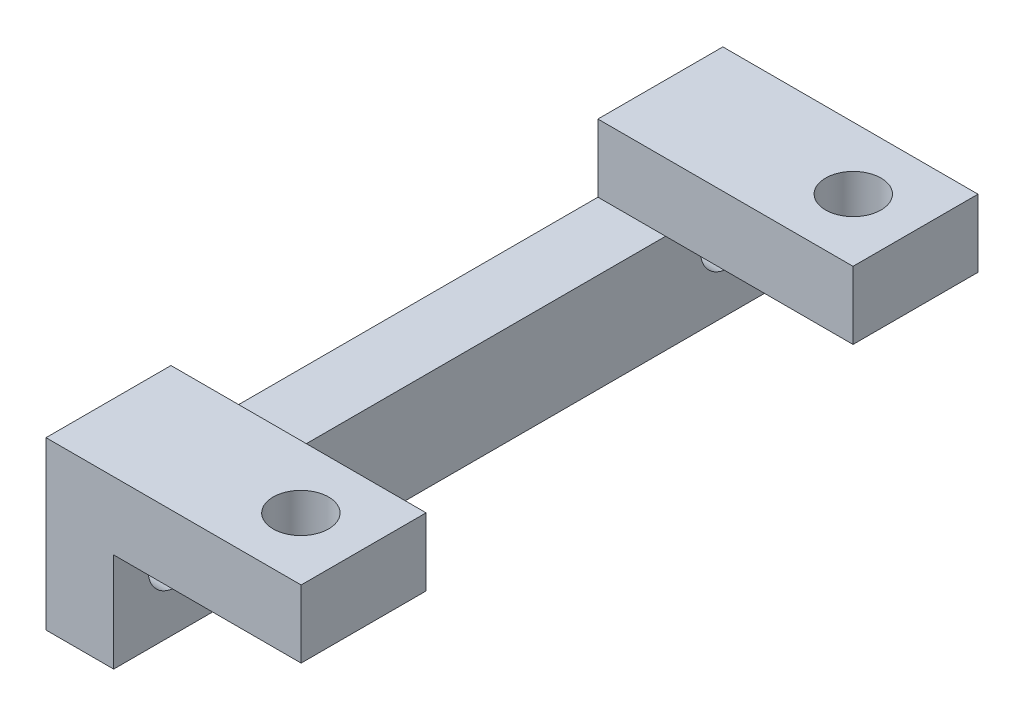
ISO-10303-21;
HEADER;
FILE_DESCRIPTION(('STEP AP214'),'2;1');
FILE_NAME('part.step','',(''),(''),'','','');
FILE_SCHEMA(('AUTOMOTIVE_DESIGN { 1 0 10303 214 1 1 1 1 }'));
ENDSEC;
DATA;
#1=APPLICATION_CONTEXT('core data for automotive mechanical design processes');
#2=APPLICATION_PROTOCOL_DEFINITION('international standard','automotive_design',2000,#1);
#3=PRODUCT_CONTEXT('',#1,'mechanical');
#4=PRODUCT('Part','Part','',(#3));
#5=PRODUCT_RELATED_PRODUCT_CATEGORY('part','',(#4));
#6=PRODUCT_DEFINITION_FORMATION('','',#4);
#7=PRODUCT_DEFINITION_CONTEXT('part definition',#1,'design');
#8=PRODUCT_DEFINITION('design','',#6,#7);
#9=PRODUCT_DEFINITION_SHAPE('','',#8);
#10=(LENGTH_UNIT() NAMED_UNIT(*) SI_UNIT(.MILLI.,.METRE.));
#11=(NAMED_UNIT(*) PLANE_ANGLE_UNIT() SI_UNIT($,.RADIAN.));
#12=(NAMED_UNIT(*) SI_UNIT($,.STERADIAN.) SOLID_ANGLE_UNIT());
#13=UNCERTAINTY_MEASURE_WITH_UNIT(LENGTH_MEASURE(1.E-05),#10,'distance_accuracy_value','');
#14=(GEOMETRIC_REPRESENTATION_CONTEXT(3) GLOBAL_UNCERTAINTY_ASSIGNED_CONTEXT((#13)) GLOBAL_UNIT_ASSIGNED_CONTEXT((#10,
#11,#12)) REPRESENTATION_CONTEXT('',''));
#15=CARTESIAN_POINT('',(0.,0.,0.));
#16=DIRECTION('',(0.,0.,1.));
#17=DIRECTION('',(1.,0.,0.));
#18=AXIS2_PLACEMENT_3D('',#15,#16,#17);
#19=CARTESIAN_POINT('',(3.302,0.,0.));
#20=DIRECTION('',(0.,0.,-1.));
#21=DIRECTION('',(-1.,0.,0.));
#22=AXIS2_PLACEMENT_3D('',#19,#20,#21);
#23=PLANE('',#22);
#24=DIRECTION('',(0.,-1.,0.));
#25=VECTOR('',#24,1.);
#26=CARTESIAN_POINT('',(0.,0.,0.));
#27=LINE('',#26,#25);
#28=CARTESIAN_POINT('',(0.,8.128,0.));
#29=VERTEX_POINT('',#28);
#30=CARTESIAN_POINT('',(0.,0.,0.));
#31=VERTEX_POINT('',#30);
#32=EDGE_CURVE('E184',#29,#31,#27,.T.);
#33=ORIENTED_EDGE('',*,*,#32,.T.);
#34=DIRECTION('',(-1.,0.,0.));
#35=VECTOR('',#34,1.);
#36=CARTESIAN_POINT('',(3.302,0.,0.));
#37=LINE('',#36,#35);
#38=CARTESIAN_POINT('',(3.302,0.,0.));
#39=VERTEX_POINT('',#38);
#40=EDGE_CURVE('E38',#39,#31,#37,.T.);
#41=ORIENTED_EDGE('',*,*,#40,.F.);
#42=DIRECTION('',(0.,-1.,0.));
#43=VECTOR('',#42,1.);
#44=CARTESIAN_POINT('',(3.302,0.,0.));
#45=LINE('',#44,#43);
#46=CARTESIAN_POINT('',(3.302,4.826,0.));
#47=VERTEX_POINT('',#46);
#48=EDGE_CURVE('E190',#47,#39,#45,.T.);
#49=ORIENTED_EDGE('',*,*,#48,.F.);
#50=DIRECTION('',(-1.,0.,0.));
#51=VECTOR('',#50,1.);
#52=CARTESIAN_POINT('',(12.446,4.826,0.));
#53=LINE('',#52,#51);
#54=CARTESIAN_POINT('',(12.446,4.826,0.));
#55=VERTEX_POINT('',#54);
#56=EDGE_CURVE('E143',#55,#47,#53,.T.);
#57=ORIENTED_EDGE('',*,*,#56,.F.);
#58=DIRECTION('',(0.,1.,0.));
#59=VECTOR('',#58,1.);
#60=CARTESIAN_POINT('',(12.446,4.826,0.));
#61=LINE('',#60,#59);
#62=CARTESIAN_POINT('',(12.446,8.128,0.));
#63=VERTEX_POINT('',#62);
#64=EDGE_CURVE('E136',#55,#63,#61,.T.);
#65=ORIENTED_EDGE('',*,*,#64,.T.);
#66=DIRECTION('',(-1.,0.,0.));
#67=VECTOR('',#66,1.);
#68=CARTESIAN_POINT('',(12.446,8.128,0.));
#69=LINE('',#68,#67);
#70=EDGE_CURVE('E119',#63,#29,#69,.T.);
#71=ORIENTED_EDGE('',*,*,#70,.T.);
#72=EDGE_LOOP('',(#33,#41,#49,#57,#65,#71));
#73=FACE_BOUND('',#72,.T.);
#74=ADVANCED_FACE('F35',(#73),#23,.F.);
#75=CARTESIAN_POINT('',(3.302,0.,0.));
#76=DIRECTION('',(0.,1.,0.));
#77=DIRECTION('',(0.,0.,1.));
#78=AXIS2_PLACEMENT_3D('',#75,#76,#77);
#79=PLANE('',#78);
#80=DIRECTION('',(0.,0.,-1.));
#81=VECTOR('',#80,1.);
#82=CARTESIAN_POINT('',(0.,0.,0.));
#83=LINE('',#82,#81);
#84=CARTESIAN_POINT('',(0.,0.,-33.02));
#85=VERTEX_POINT('',#84);
#86=EDGE_CURVE('E204',#31,#85,#83,.T.);
#87=ORIENTED_EDGE('',*,*,#86,.T.);
#88=DIRECTION('',(-1.,0.,0.));
#89=VECTOR('',#88,1.);
#90=CARTESIAN_POINT('',(3.302,0.,-33.02));
#91=LINE('',#90,#89);
#92=CARTESIAN_POINT('',(3.302,0.,-33.02));
#93=VERTEX_POINT('',#92);
#94=EDGE_CURVE('E202',#93,#85,#91,.T.);
#95=ORIENTED_EDGE('',*,*,#94,.F.);
#96=DIRECTION('',(0.,0.,-1.));
#97=VECTOR('',#96,1.);
#98=CARTESIAN_POINT('',(3.302,0.,0.));
#99=LINE('',#98,#97);
#100=EDGE_CURVE('E193',#39,#93,#99,.T.);
#101=ORIENTED_EDGE('',*,*,#100,.F.);
#102=ORIENTED_EDGE('',*,*,#40,.T.);
#103=EDGE_LOOP('',(#87,#95,#101,#102));
#104=FACE_BOUND('',#103,.T.);
#105=ADVANCED_FACE('F216',(#104),#79,.F.);
#106=CARTESIAN_POINT('',(3.302,0.,-33.02));
#107=DIRECTION('',(0.,0.,1.));
#108=DIRECTION('',(1.,0.,0.));
#109=AXIS2_PLACEMENT_3D('',#106,#107,#108);
#110=PLANE('',#109);
#111=DIRECTION('',(0.,1.,0.));
#112=VECTOR('',#111,1.);
#113=CARTESIAN_POINT('',(0.,0.,-33.02));
#114=LINE('',#113,#112);
#115=CARTESIAN_POINT('',(0.,8.128,-33.02));
#116=VERTEX_POINT('',#115);
#117=EDGE_CURVE('E206',#85,#116,#114,.T.);
#118=ORIENTED_EDGE('',*,*,#117,.T.);
#119=DIRECTION('',(-1.,0.,0.));
#120=VECTOR('',#119,1.);
#121=CARTESIAN_POINT('',(12.446,8.128,-33.02));
#122=LINE('',#121,#120);
#123=CARTESIAN_POINT('',(12.446,8.128,-33.02));
#124=VERTEX_POINT('',#123);
#125=EDGE_CURVE('E181',#124,#116,#122,.T.);
#126=ORIENTED_EDGE('',*,*,#125,.F.);
#127=DIRECTION('',(0.,-1.,0.));
#128=VECTOR('',#127,1.);
#129=CARTESIAN_POINT('',(12.446,4.826,-33.02));
#130=LINE('',#129,#128);
#131=CARTESIAN_POINT('',(12.446,4.826,-33.02));
#132=VERTEX_POINT('',#131);
#133=EDGE_CURVE('E163',#124,#132,#130,.T.);
#134=ORIENTED_EDGE('',*,*,#133,.T.);
#135=DIRECTION('',(-1.,0.,0.));
#136=VECTOR('',#135,1.);
#137=CARTESIAN_POINT('',(12.446,4.826,-33.02));
#138=LINE('',#137,#136);
#139=CARTESIAN_POINT('',(3.302,4.826,-33.02));
#140=VERTEX_POINT('',#139);
#141=EDGE_CURVE('E176',#132,#140,#138,.T.);
#142=ORIENTED_EDGE('',*,*,#141,.T.);
#143=DIRECTION('',(0.,1.,0.));
#144=VECTOR('',#143,1.);
#145=CARTESIAN_POINT('',(3.302,0.,-33.02));
#146=LINE('',#145,#144);
#147=EDGE_CURVE('E195',#93,#140,#146,.T.);
#148=ORIENTED_EDGE('',*,*,#147,.F.);
#149=ORIENTED_EDGE('',*,*,#94,.T.);
#150=EDGE_LOOP('',(#118,#126,#134,#142,#148,#149));
#151=FACE_BOUND('',#150,.T.);
#152=ADVANCED_FACE('F220',(#151),#110,.F.);
#153=CARTESIAN_POINT('',(3.302,4.826,0.));
#154=DIRECTION('',(0.,-1.,0.));
#155=DIRECTION('',(0.,0.,-1.));
#156=AXIS2_PLACEMENT_3D('',#153,#154,#155);
#157=PLANE('',#156);
#158=DIRECTION('',(0.,0.,1.));
#159=VECTOR('',#158,1.);
#160=CARTESIAN_POINT('',(0.,4.826,0.));
#161=LINE('',#160,#159);
#162=CARTESIAN_POINT('',(0.,4.826,-26.924));
#163=VERTEX_POINT('',#162);
#164=CARTESIAN_POINT('',(0.,4.826,-6.096));
#165=VERTEX_POINT('',#164);
#166=EDGE_CURVE('E55',#163,#165,#161,.T.);
#167=ORIENTED_EDGE('',*,*,#166,.T.);
#168=DIRECTION('',(-1.,0.,0.));
#169=VECTOR('',#168,1.);
#170=CARTESIAN_POINT('',(12.446,4.826,-6.096));
#171=LINE('',#170,#169);
#172=CARTESIAN_POINT('',(3.302,4.826,-6.096));
#173=VERTEX_POINT('',#172);
#174=EDGE_CURVE('E51',#173,#165,#171,.T.);
#175=ORIENTED_EDGE('',*,*,#174,.F.);
#176=DIRECTION('',(0.,0.,1.));
#177=VECTOR('',#176,1.);
#178=CARTESIAN_POINT('',(3.302,4.826,0.));
#179=LINE('',#178,#177);
#180=CARTESIAN_POINT('',(3.302,4.826,-26.924));
#181=VERTEX_POINT('',#180);
#182=EDGE_CURVE('E198',#181,#173,#179,.T.);
#183=ORIENTED_EDGE('',*,*,#182,.F.);
#184=DIRECTION('',(-1.,0.,0.));
#185=VECTOR('',#184,1.);
#186=CARTESIAN_POINT('',(12.446,4.826,-26.924));
#187=LINE('',#186,#185);
#188=EDGE_CURVE('E11',#181,#163,#187,.T.);
#189=ORIENTED_EDGE('',*,*,#188,.T.);
#190=EDGE_LOOP('',(#167,#175,#183,#189));
#191=FACE_BOUND('',#190,.T.);
#192=ADVANCED_FACE('F240',(#191),#157,.F.);
#193=CARTESIAN_POINT('',(3.302,0.,0.));
#194=DIRECTION('',(-1.,0.,0.));
#195=DIRECTION('',(0.,0.,1.));
#196=AXIS2_PLACEMENT_3D('',#193,#194,#195);
#197=PLANE('',#196);
#198=CARTESIAN_POINT('',(3.302,3.302,-3.0353));
#199=DIRECTION('',(1.,0.,0.));
#200=DIRECTION('',(0.,0.,-1.));
#201=AXIS2_PLACEMENT_3D('',#198,#199,#200);
#202=CIRCLE('',#201,1.35255);
#203=CARTESIAN_POINT('',(3.302,3.302,-4.38785));
#204=VERTEX_POINT('',#203);
#205=EDGE_CURVE('E421',#204,#204,#202,.T.);
#206=ORIENTED_EDGE('',*,*,#205,.F.);
#207=EDGE_LOOP('',(#206));
#208=FACE_BOUND('',#207,.T.);
#209=CARTESIAN_POINT('',(3.302,3.302,-29.9847));
#210=DIRECTION('',(1.,0.,0.));
#211=DIRECTION('',(0.,0.,-1.));
#212=AXIS2_PLACEMENT_3D('',#209,#210,#211);
#213=CIRCLE('',#212,1.35255);
#214=CARTESIAN_POINT('',(3.302,3.302,-31.33725));
#215=VERTEX_POINT('',#214);
#216=EDGE_CURVE('E426',#215,#215,#213,.T.);
#217=ORIENTED_EDGE('',*,*,#216,.F.);
#218=EDGE_LOOP('',(#217));
#219=FACE_BOUND('',#218,.T.);
#220=ORIENTED_EDGE('',*,*,#48,.T.);
#221=ORIENTED_EDGE('',*,*,#100,.T.);
#222=ORIENTED_EDGE('',*,*,#147,.T.);
#223=EDGE_CURVE('E199',#140,#181,#179,.T.);
#224=ORIENTED_EDGE('',*,*,#223,.T.);
#225=ORIENTED_EDGE('',*,*,#182,.T.);
#226=DIRECTION('',(0.,0.,1.));
#227=VECTOR('',#226,1.);
#228=CARTESIAN_POINT('',(3.302,4.826,0.));
#229=LINE('',#228,#227);
#230=EDGE_CURVE('E156',#173,#47,#229,.T.);
#231=ORIENTED_EDGE('',*,*,#230,.T.);
#232=EDGE_LOOP('',(#220,#221,#222,#224,#225,#231));
#233=FACE_BOUND('',#232,.T.);
#234=ADVANCED_FACE('F231',(#208,#219,#233),#197,.F.);
#235=CARTESIAN_POINT('',(0.,0.,0.));
#236=DIRECTION('',(-1.,0.,0.));
#237=DIRECTION('',(0.,0.,1.));
#238=AXIS2_PLACEMENT_3D('',#235,#236,#237);
#239=PLANE('',#238);
#240=CARTESIAN_POINT('',(0.,3.302,-3.0353));
#241=DIRECTION('',(1.,0.,0.));
#242=DIRECTION('',(0.,0.,-1.));
#243=AXIS2_PLACEMENT_3D('',#240,#241,#242);
#244=CIRCLE('',#243,1.35255);
#245=CARTESIAN_POINT('',(0.,3.302,-4.38785));
#246=VERTEX_POINT('',#245);
#247=EDGE_CURVE('E424',#246,#246,#244,.T.);
#248=ORIENTED_EDGE('',*,*,#247,.T.);
#249=EDGE_LOOP('',(#248));
#250=FACE_BOUND('',#249,.T.);
#251=CARTESIAN_POINT('',(0.,3.302,-29.9847));
#252=DIRECTION('',(1.,0.,0.));
#253=DIRECTION('',(0.,0.,-1.));
#254=AXIS2_PLACEMENT_3D('',#251,#252,#253);
#255=CIRCLE('',#254,1.35255);
#256=CARTESIAN_POINT('',(0.,3.302,-31.33725));
#257=VERTEX_POINT('',#256);
#258=EDGE_CURVE('E149',#257,#257,#255,.T.);
#259=ORIENTED_EDGE('',*,*,#258,.T.);
#260=EDGE_LOOP('',(#259));
#261=FACE_BOUND('',#260,.T.);
#262=ORIENTED_EDGE('',*,*,#32,.F.);
#263=DIRECTION('',(0.,0.,-1.));
#264=VECTOR('',#263,1.);
#265=CARTESIAN_POINT('',(0.,8.128,0.));
#266=LINE('',#265,#264);
#267=CARTESIAN_POINT('',(0.,8.128,-6.096));
#268=VERTEX_POINT('',#267);
#269=EDGE_CURVE('E124',#29,#268,#266,.T.);
#270=ORIENTED_EDGE('',*,*,#269,.T.);
#271=DIRECTION('',(0.,-1.,0.));
#272=VECTOR('',#271,1.);
#273=CARTESIAN_POINT('',(0.,4.826,-6.096));
#274=LINE('',#273,#272);
#275=EDGE_CURVE('E144',#268,#165,#274,.T.);
#276=ORIENTED_EDGE('',*,*,#275,.T.);
#277=ORIENTED_EDGE('',*,*,#166,.F.);
#278=DIRECTION('',(0.,1.,0.));
#279=VECTOR('',#278,1.);
#280=CARTESIAN_POINT('',(0.,4.826,-26.924));
#281=LINE('',#280,#279);
#282=CARTESIAN_POINT('',(0.,8.128,-26.924));
#283=VERTEX_POINT('',#282);
#284=EDGE_CURVE('E162',#163,#283,#281,.T.);
#285=ORIENTED_EDGE('',*,*,#284,.T.);
#286=DIRECTION('',(0.,0.,-1.));
#287=VECTOR('',#286,1.);
#288=CARTESIAN_POINT('',(0.,8.128,-33.02));
#289=LINE('',#288,#287);
#290=EDGE_CURVE('E167',#283,#116,#289,.T.);
#291=ORIENTED_EDGE('',*,*,#290,.T.);
#292=ORIENTED_EDGE('',*,*,#117,.F.);
#293=ORIENTED_EDGE('',*,*,#86,.F.);
#294=EDGE_LOOP('',(#262,#270,#276,#277,#285,#291,#292,#293));
#295=FACE_BOUND('',#294,.T.);
#296=ADVANCED_FACE('F218',(#250,#261,#295),#239,.T.);
#297=CARTESIAN_POINT('',(12.446,4.826,-33.02));
#298=DIRECTION('',(0.,-1.,0.));
#299=DIRECTION('',(0.,0.,-1.));
#300=AXIS2_PLACEMENT_3D('',#297,#298,#299);
#301=PLANE('',#300);
#302=CARTESIAN_POINT('',(9.398,4.826,-29.9847));
#303=DIRECTION('',(0.,-1.,0.));
#304=DIRECTION('',(0.,0.,-1.));
#305=AXIS2_PLACEMENT_3D('',#302,#303,#304);
#306=CIRCLE('',#305,1.35254999999999);
#307=CARTESIAN_POINT('',(9.398,4.826,-31.33725));
#308=VERTEX_POINT('',#307);
#309=EDGE_CURVE('E418',#308,#308,#306,.T.);
#310=ORIENTED_EDGE('',*,*,#309,.F.);
#311=EDGE_LOOP('',(#310));
#312=FACE_BOUND('',#311,.T.);
#313=ORIENTED_EDGE('',*,*,#223,.F.);
#314=ORIENTED_EDGE('',*,*,#141,.F.);
#315=DIRECTION('',(0.,0.,1.));
#316=VECTOR('',#315,1.);
#317=CARTESIAN_POINT('',(12.446,4.826,-33.02));
#318=LINE('',#317,#316);
#319=CARTESIAN_POINT('',(12.446,4.826,-26.924));
#320=VERTEX_POINT('',#319);
#321=EDGE_CURVE('E166',#132,#320,#318,.T.);
#322=ORIENTED_EDGE('',*,*,#321,.T.);
#323=EDGE_CURVE('E44',#320,#181,#187,.T.);
#324=ORIENTED_EDGE('',*,*,#323,.T.);
#325=EDGE_LOOP('',(#313,#314,#322,#324));
#326=FACE_BOUND('',#325,.T.);
#327=ADVANCED_FACE('F326',(#312,#326),#301,.T.);
#328=CARTESIAN_POINT('',(12.446,8.128,-33.02));
#329=DIRECTION('',(0.,1.,0.));
#330=DIRECTION('',(0.,0.,1.));
#331=AXIS2_PLACEMENT_3D('',#328,#329,#330);
#332=PLANE('',#331);
#333=CARTESIAN_POINT('',(9.398,8.128,-29.9847));
#334=DIRECTION('',(0.,1.,0.));
#335=DIRECTION('',(0.,0.,1.));
#336=AXIS2_PLACEMENT_3D('',#333,#334,#335);
#337=CIRCLE('',#336,1.35254999999999);
#338=CARTESIAN_POINT('',(9.398,8.128,-28.63215));
#339=VERTEX_POINT('',#338);
#340=EDGE_CURVE('E413',#339,#339,#337,.T.);
#341=ORIENTED_EDGE('',*,*,#340,.F.);
#342=EDGE_LOOP('',(#341));
#343=FACE_BOUND('',#342,.T.);
#344=ORIENTED_EDGE('',*,*,#290,.F.);
#345=DIRECTION('',(-1.,0.,0.));
#346=VECTOR('',#345,1.);
#347=CARTESIAN_POINT('',(12.446,8.128,-26.924));
#348=LINE('',#347,#346);
#349=CARTESIAN_POINT('',(12.446,8.128,-26.924));
#350=VERTEX_POINT('',#349);
#351=EDGE_CURVE('E185',#350,#283,#348,.T.);
#352=ORIENTED_EDGE('',*,*,#351,.F.);
#353=DIRECTION('',(0.,0.,-1.));
#354=VECTOR('',#353,1.);
#355=CARTESIAN_POINT('',(12.446,8.128,-33.02));
#356=LINE('',#355,#354);
#357=EDGE_CURVE('E173',#350,#124,#356,.T.);
#358=ORIENTED_EDGE('',*,*,#357,.T.);
#359=ORIENTED_EDGE('',*,*,#125,.T.);
#360=EDGE_LOOP('',(#344,#352,#358,#359));
#361=FACE_BOUND('',#360,.T.);
#362=ADVANCED_FACE('F223',(#343,#361),#332,.T.);
#363=CARTESIAN_POINT('',(12.446,4.826,-26.924));
#364=DIRECTION('',(0.,0.,1.));
#365=DIRECTION('',(1.,0.,0.));
#366=AXIS2_PLACEMENT_3D('',#363,#364,#365);
#367=PLANE('',#366);
#368=ORIENTED_EDGE('',*,*,#284,.F.);
#369=ORIENTED_EDGE('',*,*,#188,.F.);
#370=ORIENTED_EDGE('',*,*,#323,.F.);
#371=DIRECTION('',(0.,1.,0.));
#372=VECTOR('',#371,1.);
#373=CARTESIAN_POINT('',(12.446,4.826,-26.924));
#374=LINE('',#373,#372);
#375=EDGE_CURVE('E170',#320,#350,#374,.T.);
#376=ORIENTED_EDGE('',*,*,#375,.T.);
#377=ORIENTED_EDGE('',*,*,#351,.T.);
#378=EDGE_LOOP('',(#368,#369,#370,#376,#377));
#379=FACE_BOUND('',#378,.T.);
#380=ADVANCED_FACE('F239',(#379),#367,.T.);
#381=CARTESIAN_POINT('',(12.446,0.,0.));
#382=DIRECTION('',(1.,0.,0.));
#383=DIRECTION('',(0.,0.,-1.));
#384=AXIS2_PLACEMENT_3D('',#381,#382,#383);
#385=PLANE('',#384);
#386=ORIENTED_EDGE('',*,*,#133,.F.);
#387=ORIENTED_EDGE('',*,*,#357,.F.);
#388=ORIENTED_EDGE('',*,*,#375,.F.);
#389=ORIENTED_EDGE('',*,*,#321,.F.);
#390=EDGE_LOOP('',(#386,#387,#388,#389));
#391=FACE_BOUND('',#390,.T.);
#392=ADVANCED_FACE('F227',(#391),#385,.T.);
#393=CARTESIAN_POINT('',(12.446,4.826,0.));
#394=DIRECTION('',(0.,-1.,0.));
#395=DIRECTION('',(0.,0.,-1.));
#396=AXIS2_PLACEMENT_3D('',#393,#394,#395);
#397=PLANE('',#396);
#398=CARTESIAN_POINT('',(9.398,4.826,-3.0353));
#399=DIRECTION('',(0.,-1.,0.));
#400=DIRECTION('',(0.,0.,-1.));
#401=AXIS2_PLACEMENT_3D('',#398,#399,#400);
#402=CIRCLE('',#401,1.35254999999999);
#403=CARTESIAN_POINT('',(9.398,4.826,-4.38784999999999));
#404=VERTEX_POINT('',#403);
#405=EDGE_CURVE('E408',#404,#404,#402,.T.);
#406=ORIENTED_EDGE('',*,*,#405,.F.);
#407=EDGE_LOOP('',(#406));
#408=FACE_BOUND('',#407,.T.);
#409=ORIENTED_EDGE('',*,*,#230,.F.);
#410=CARTESIAN_POINT('',(12.446,4.826,-6.096));
#411=VERTEX_POINT('',#410);
#412=EDGE_CURVE('E157',#411,#173,#171,.T.);
#413=ORIENTED_EDGE('',*,*,#412,.F.);
#414=DIRECTION('',(0.,0.,1.));
#415=VECTOR('',#414,1.);
#416=CARTESIAN_POINT('',(12.446,4.826,0.));
#417=LINE('',#416,#415);
#418=EDGE_CURVE('E129',#411,#55,#417,.T.);
#419=ORIENTED_EDGE('',*,*,#418,.T.);
#420=ORIENTED_EDGE('',*,*,#56,.T.);
#421=EDGE_LOOP('',(#409,#413,#419,#420));
#422=FACE_BOUND('',#421,.T.);
#423=ADVANCED_FACE('F234',(#408,#422),#397,.T.);
#424=CARTESIAN_POINT('',(12.446,4.826,-6.096));
#425=DIRECTION('',(0.,0.,-1.));
#426=DIRECTION('',(-1.,0.,0.));
#427=AXIS2_PLACEMENT_3D('',#424,#425,#426);
#428=PLANE('',#427);
#429=ORIENTED_EDGE('',*,*,#275,.F.);
#430=DIRECTION('',(-1.,0.,0.));
#431=VECTOR('',#430,1.);
#432=CARTESIAN_POINT('',(12.446,8.128,-6.096));
#433=LINE('',#432,#431);
#434=CARTESIAN_POINT('',(12.446,8.128,-6.096));
#435=VERTEX_POINT('',#434);
#436=EDGE_CURVE('E128',#435,#268,#433,.T.);
#437=ORIENTED_EDGE('',*,*,#436,.F.);
#438=DIRECTION('',(0.,-1.,0.));
#439=VECTOR('',#438,1.);
#440=CARTESIAN_POINT('',(12.446,4.826,-6.096));
#441=LINE('',#440,#439);
#442=EDGE_CURVE('E139',#435,#411,#441,.T.);
#443=ORIENTED_EDGE('',*,*,#442,.T.);
#444=ORIENTED_EDGE('',*,*,#412,.T.);
#445=ORIENTED_EDGE('',*,*,#174,.T.);
#446=EDGE_LOOP('',(#429,#437,#443,#444,#445));
#447=FACE_BOUND('',#446,.T.);
#448=ADVANCED_FACE('F237',(#447),#428,.T.);
#449=CARTESIAN_POINT('',(12.446,8.128,0.));
#450=DIRECTION('',(0.,1.,0.));
#451=DIRECTION('',(0.,0.,1.));
#452=AXIS2_PLACEMENT_3D('',#449,#450,#451);
#453=PLANE('',#452);
#454=CARTESIAN_POINT('',(9.398,8.128,-3.0353));
#455=DIRECTION('',(0.,1.,0.));
#456=DIRECTION('',(0.,0.,1.));
#457=AXIS2_PLACEMENT_3D('',#454,#455,#456);
#458=CIRCLE('',#457,1.35254999999999);
#459=CARTESIAN_POINT('',(9.398,8.128,-1.68275000000001));
#460=VERTEX_POINT('',#459);
#461=EDGE_CURVE('E411',#460,#460,#458,.T.);
#462=ORIENTED_EDGE('',*,*,#461,.F.);
#463=EDGE_LOOP('',(#462));
#464=FACE_BOUND('',#463,.T.);
#465=ORIENTED_EDGE('',*,*,#269,.F.);
#466=ORIENTED_EDGE('',*,*,#70,.F.);
#467=DIRECTION('',(0.,0.,-1.));
#468=VECTOR('',#467,1.);
#469=CARTESIAN_POINT('',(12.446,8.128,0.));
#470=LINE('',#469,#468);
#471=EDGE_CURVE('E122',#63,#435,#470,.T.);
#472=ORIENTED_EDGE('',*,*,#471,.T.);
#473=ORIENTED_EDGE('',*,*,#436,.T.);
#474=EDGE_LOOP('',(#465,#466,#472,#473));
#475=FACE_BOUND('',#474,.T.);
#476=ADVANCED_FACE('F121',(#464,#475),#453,.T.);
#477=CARTESIAN_POINT('',(12.446,0.,0.));
#478=DIRECTION('',(-1.,0.,0.));
#479=DIRECTION('',(0.,0.,1.));
#480=AXIS2_PLACEMENT_3D('',#477,#478,#479);
#481=PLANE('',#480);
#482=ORIENTED_EDGE('',*,*,#64,.F.);
#483=ORIENTED_EDGE('',*,*,#418,.F.);
#484=ORIENTED_EDGE('',*,*,#442,.F.);
#485=ORIENTED_EDGE('',*,*,#471,.F.);
#486=EDGE_LOOP('',(#482,#483,#484,#485));
#487=FACE_BOUND('',#486,.T.);
#488=ADVANCED_FACE('F134',(#487),#481,.F.);
#489=CARTESIAN_POINT('',(3.302,3.302,-29.9847));
#490=DIRECTION('',(1.,0.,0.));
#491=DIRECTION('',(0.,0.,-1.));
#492=AXIS2_PLACEMENT_3D('',#489,#490,#491);
#493=CYLINDRICAL_SURFACE('',#492,1.35255);
#494=ORIENTED_EDGE('',*,*,#258,.F.);
#495=EDGE_LOOP('',(#494));
#496=FACE_BOUND('',#495,.T.);
#497=ORIENTED_EDGE('',*,*,#216,.T.);
#498=EDGE_LOOP('',(#497));
#499=FACE_BOUND('',#498,.T.);
#500=ADVANCED_FACE('F309',(#496,#499),#493,.F.);
#501=CARTESIAN_POINT('',(3.302,3.302,-3.0353));
#502=DIRECTION('',(1.,0.,0.));
#503=DIRECTION('',(0.,0.,-1.));
#504=AXIS2_PLACEMENT_3D('',#501,#502,#503);
#505=CYLINDRICAL_SURFACE('',#504,1.35255);
#506=ORIENTED_EDGE('',*,*,#247,.F.);
#507=EDGE_LOOP('',(#506));
#508=FACE_BOUND('',#507,.T.);
#509=ORIENTED_EDGE('',*,*,#205,.T.);
#510=EDGE_LOOP('',(#509));
#511=FACE_BOUND('',#510,.T.);
#512=ADVANCED_FACE('F336',(#508,#511),#505,.F.);
#513=CARTESIAN_POINT('',(9.398,8.128,-29.9847));
#514=DIRECTION('',(0.,1.,0.));
#515=DIRECTION('',(0.,0.,1.));
#516=AXIS2_PLACEMENT_3D('',#513,#514,#515);
#517=CYLINDRICAL_SURFACE('',#516,1.35254999999999);
#518=ORIENTED_EDGE('',*,*,#309,.T.);
#519=EDGE_LOOP('',(#518));
#520=FACE_BOUND('',#519,.T.);
#521=ORIENTED_EDGE('',*,*,#340,.T.);
#522=EDGE_LOOP('',(#521));
#523=FACE_BOUND('',#522,.T.);
#524=ADVANCED_FACE('F348',(#520,#523),#517,.F.);
#525=CARTESIAN_POINT('',(9.398,8.128,-3.0353));
#526=DIRECTION('',(0.,1.,0.));
#527=DIRECTION('',(0.,0.,1.));
#528=AXIS2_PLACEMENT_3D('',#525,#526,#527);
#529=CYLINDRICAL_SURFACE('',#528,1.35254999999999);
#530=ORIENTED_EDGE('',*,*,#405,.T.);
#531=EDGE_LOOP('',(#530));
#532=FACE_BOUND('',#531,.T.);
#533=ORIENTED_EDGE('',*,*,#461,.T.);
#534=EDGE_LOOP('',(#533));
#535=FACE_BOUND('',#534,.T.);
#536=ADVANCED_FACE('F386',(#532,#535),#529,.F.);
#537=CLOSED_SHELL('',(#74,#105,#152,#192,#234,#296,#327,#362,#380,#392,#423,#448,#476,#488,#500,
#512,#524,#536));
#538=MANIFOLD_SOLID_BREP('B2',#537);
#539=ADVANCED_BREP_SHAPE_REPRESENTATION('',(#18,#538),#14);
#540=SHAPE_DEFINITION_REPRESENTATION(#9,#539);
ENDSEC;
END-ISO-10303-21;
